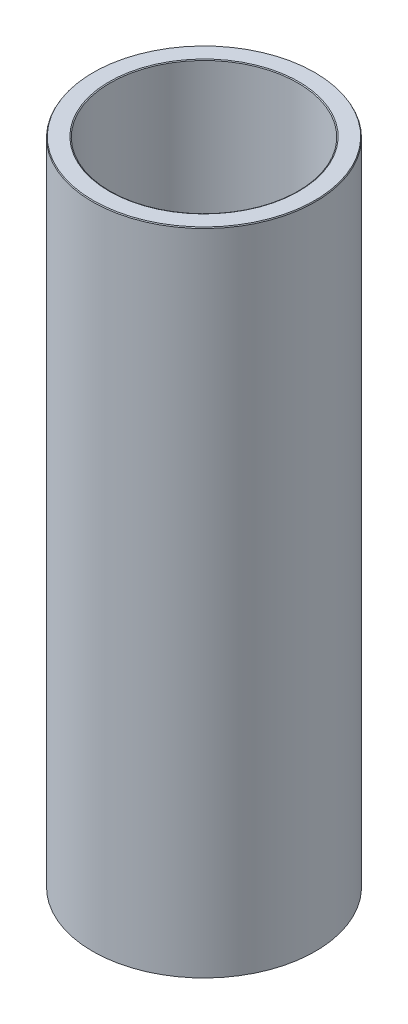
ISO-10303-21;
HEADER;
FILE_DESCRIPTION(('STEP AP214'),'2;1');
FILE_NAME('part.step','',(''),(''),'','','');
FILE_SCHEMA(('AUTOMOTIVE_DESIGN { 1 0 10303 214 1 1 1 1 }'));
ENDSEC;
DATA;
#1=APPLICATION_CONTEXT('core data for automotive mechanical design processes');
#2=APPLICATION_PROTOCOL_DEFINITION('international standard','automotive_design',2000,#1);
#3=PRODUCT_CONTEXT('',#1,'mechanical');
#4=PRODUCT('Part','Part','',(#3));
#5=PRODUCT_RELATED_PRODUCT_CATEGORY('part','',(#4));
#6=PRODUCT_DEFINITION_FORMATION('','',#4);
#7=PRODUCT_DEFINITION_CONTEXT('part definition',#1,'design');
#8=PRODUCT_DEFINITION('design','',#6,#7);
#9=PRODUCT_DEFINITION_SHAPE('','',#8);
#10=(LENGTH_UNIT() NAMED_UNIT(*) SI_UNIT(.MILLI.,.METRE.));
#11=(NAMED_UNIT(*) PLANE_ANGLE_UNIT() SI_UNIT($,.RADIAN.));
#12=(NAMED_UNIT(*) SI_UNIT($,.STERADIAN.) SOLID_ANGLE_UNIT());
#13=UNCERTAINTY_MEASURE_WITH_UNIT(LENGTH_MEASURE(1.E-05),#10,'distance_accuracy_value','');
#14=(GEOMETRIC_REPRESENTATION_CONTEXT(3) GLOBAL_UNCERTAINTY_ASSIGNED_CONTEXT((#13)) GLOBAL_UNIT_ASSIGNED_CONTEXT((#10,
#11,#12)) REPRESENTATION_CONTEXT('',''));
#15=CARTESIAN_POINT('',(0.,0.,0.));
#16=DIRECTION('',(0.,0.,1.));
#17=DIRECTION('',(1.,0.,0.));
#18=AXIS2_PLACEMENT_3D('',#15,#16,#17);
#19=CARTESIAN_POINT('',(0.,277.417146859064,0.));
#20=DIRECTION('',(0.,-1.,0.));
#21=DIRECTION('',(0.,0.,-1.));
#22=AXIS2_PLACEMENT_3D('',#19,#20,#21);
#23=CYLINDRICAL_SURFACE('',#22,47.5);
#24=CARTESIAN_POINT('',(0.,0.238274903493763,0.));
#25=DIRECTION('',(0.,1.,0.));
#26=DIRECTION('',(0.,0.,1.));
#27=AXIS2_PLACEMENT_3D('',#24,#25,#26);
#28=CIRCLE('',#27,47.5);
#29=CARTESIAN_POINT('',(0.,0.238274903493763,47.5));
#30=VERTEX_POINT('',#29);
#31=EDGE_CURVE('E10',#30,#30,#28,.T.);
#32=ORIENTED_EDGE('',*,*,#31,.T.);
#33=EDGE_LOOP('',(#32));
#34=FACE_BOUND('',#33,.T.);
#35=CARTESIAN_POINT('',(0.,277.004442620044,0.));
#36=DIRECTION('',(0.,1.,0.));
#37=DIRECTION('',(0.,0.,1.));
#38=AXIS2_PLACEMENT_3D('',#35,#36,#37);
#39=CIRCLE('',#38,47.5);
#40=CARTESIAN_POINT('',(0.,277.004442620044,47.5));
#41=VERTEX_POINT('',#40);
#42=EDGE_CURVE('E50',#41,#41,#39,.F.);
#43=ORIENTED_EDGE('',*,*,#42,.T.);
#44=EDGE_LOOP('',(#43));
#45=FACE_BOUND('',#44,.T.);
#46=ADVANCED_FACE('F39',(#34,#45),#23,.T.);
#47=CARTESIAN_POINT('',(0.,277.417146859064,0.));
#48=DIRECTION('',(0.,1.,0.));
#49=DIRECTION('',(0.,0.,1.));
#50=AXIS2_PLACEMENT_3D('',#47,#48,#49);
#51=PLANE('',#50);
#52=CARTESIAN_POINT('',(0.,277.417146859064,0.));
#53=DIRECTION('',(0.,1.,0.));
#54=DIRECTION('',(0.,0.,1.));
#55=AXIS2_PLACEMENT_3D('',#52,#53,#54);
#56=CIRCLE('',#55,40.4499099702416);
#57=CARTESIAN_POINT('',(0.,277.417146859064,40.4499099702416));
#58=VERTEX_POINT('',#57);
#59=EDGE_CURVE('E58',#58,#58,#56,.F.);
#60=ORIENTED_EDGE('',*,*,#59,.T.);
#61=EDGE_LOOP('',(#60));
#62=FACE_BOUND('',#61,.T.);
#63=CARTESIAN_POINT('',(0.,277.417146859064,0.));
#64=DIRECTION('',(0.,1.,0.));
#65=DIRECTION('',(0.,0.,1.));
#66=AXIS2_PLACEMENT_3D('',#63,#64,#65);
#67=CIRCLE('',#66,47.2617250965063);
#68=CARTESIAN_POINT('',(0.,277.417146859064,47.2617250965063));
#69=VERTEX_POINT('',#68);
#70=EDGE_CURVE('E61',#69,#69,#67,.T.);
#71=ORIENTED_EDGE('',*,*,#70,.T.);
#72=EDGE_LOOP('',(#71));
#73=FACE_BOUND('',#72,.T.);
#74=ADVANCED_FACE('F88',(#62,#73),#51,.T.);
#75=CARTESIAN_POINT('',(0.,0.,0.));
#76=DIRECTION('',(0.,1.,0.));
#77=DIRECTION('',(0.,0.,1.));
#78=AXIS2_PLACEMENT_3D('',#75,#76,#77);
#79=PLANE('',#78);
#80=CARTESIAN_POINT('',(0.,0.,0.));
#81=DIRECTION('',(0.,1.,0.));
#82=DIRECTION('',(0.,0.,1.));
#83=AXIS2_PLACEMENT_3D('',#80,#81,#82);
#84=CIRCLE('',#83,40.2754806347156);
#85=CARTESIAN_POINT('',(0.,0.,40.2754806347156));
#86=VERTEX_POINT('',#85);
#87=EDGE_CURVE('E51',#86,#86,#84,.T.);
#88=ORIENTED_EDGE('',*,*,#87,.T.);
#89=EDGE_LOOP('',(#88));
#90=FACE_BOUND('',#89,.T.);
#91=CARTESIAN_POINT('',(0.,0.,0.));
#92=DIRECTION('',(0.,1.,0.));
#93=DIRECTION('',(0.,0.,1.));
#94=AXIS2_PLACEMENT_3D('',#91,#92,#93);
#95=CIRCLE('',#94,47.0872957609803);
#96=CARTESIAN_POINT('',(0.,0.,47.0872957609803));
#97=VERTEX_POINT('',#96);
#98=EDGE_CURVE('E54',#97,#97,#95,.F.);
#99=ORIENTED_EDGE('',*,*,#98,.T.);
#100=EDGE_LOOP('',(#99));
#101=FACE_BOUND('',#100,.T.);
#102=ADVANCED_FACE('F83',(#90,#101),#79,.F.);
#103=CARTESIAN_POINT('',(0.,277.417146859064,0.));
#104=DIRECTION('',(0.,-1.,0.));
#105=DIRECTION('',(0.,0.,-1.));
#106=AXIS2_PLACEMENT_3D('',#103,#104,#105);
#107=CYLINDRICAL_SURFACE('',#106,40.0372057312218);
#108=CARTESIAN_POINT('',(0.,277.17887195557,0.));
#109=DIRECTION('',(0.,1.,0.));
#110=DIRECTION('',(0.,0.,1.));
#111=AXIS2_PLACEMENT_3D('',#108,#109,#110);
#112=CIRCLE('',#111,40.0372057312218);
#113=CARTESIAN_POINT('',(0.,277.17887195557,40.0372057312218));
#114=VERTEX_POINT('',#113);
#115=EDGE_CURVE('E67',#114,#114,#112,.T.);
#116=ORIENTED_EDGE('',*,*,#115,.T.);
#117=EDGE_LOOP('',(#116));
#118=FACE_BOUND('',#117,.T.);
#119=CARTESIAN_POINT('',(0.,0.41270423901979,0.));
#120=DIRECTION('',(0.,1.,0.));
#121=DIRECTION('',(0.,0.,1.));
#122=AXIS2_PLACEMENT_3D('',#119,#120,#121);
#123=CIRCLE('',#122,40.0372057312218);
#124=CARTESIAN_POINT('',(0.,0.41270423901979,40.0372057312218));
#125=VERTEX_POINT('',#124);
#126=EDGE_CURVE('E69',#125,#125,#123,.F.);
#127=ORIENTED_EDGE('',*,*,#126,.T.);
#128=EDGE_LOOP('',(#127));
#129=FACE_BOUND('',#128,.T.);
#130=ADVANCED_FACE('F71',(#118,#129),#107,.F.);
#131=CARTESIAN_POINT('',(0.,277.17887195557,0.));
#132=DIRECTION('',(0.,1.,0.));
#133=DIRECTION('',(0.,0.,1.));
#134=AXIS2_PLACEMENT_3D('',#131,#132,#133);
#135=CONICAL_SURFACE('',#134,40.0372057312218,1.04719755119654);
#136=ORIENTED_EDGE('',*,*,#59,.F.);
#137=EDGE_LOOP('',(#136));
#138=FACE_BOUND('',#137,.T.);
#139=ORIENTED_EDGE('',*,*,#115,.F.);
#140=EDGE_LOOP('',(#139));
#141=FACE_BOUND('',#140,.T.);
#142=ADVANCED_FACE('F77',(#138,#141),#135,.F.);
#143=CARTESIAN_POINT('',(0.,0.,0.));
#144=DIRECTION('',(0.,-1.,0.));
#145=DIRECTION('',(0.,0.,-1.));
#146=AXIS2_PLACEMENT_3D('',#143,#144,#145);
#147=CONICAL_SURFACE('',#146,40.2754806347156,0.523598775598263);
#148=ORIENTED_EDGE('',*,*,#126,.F.);
#149=EDGE_LOOP('',(#148));
#150=FACE_BOUND('',#149,.T.);
#151=ORIENTED_EDGE('',*,*,#87,.F.);
#152=EDGE_LOOP('',(#151));
#153=FACE_BOUND('',#152,.T.);
#154=ADVANCED_FACE('F73',(#150,#153),#147,.F.);
#155=CARTESIAN_POINT('',(0.,0.238274903493763,0.));
#156=DIRECTION('',(0.,1.,0.));
#157=DIRECTION('',(0.,0.,1.));
#158=AXIS2_PLACEMENT_3D('',#155,#156,#157);
#159=CONICAL_SURFACE('',#158,47.5,1.04719755119658);
#160=ORIENTED_EDGE('',*,*,#98,.F.);
#161=EDGE_LOOP('',(#160));
#162=FACE_BOUND('',#161,.T.);
#163=ORIENTED_EDGE('',*,*,#31,.F.);
#164=EDGE_LOOP('',(#163));
#165=FACE_BOUND('',#164,.T.);
#166=ADVANCED_FACE('F76',(#162,#165),#159,.T.);
#167=CARTESIAN_POINT('',(0.,277.417146859064,0.));
#168=DIRECTION('',(0.,-1.,0.));
#169=DIRECTION('',(0.,0.,-1.));
#170=AXIS2_PLACEMENT_3D('',#167,#168,#169);
#171=CONICAL_SURFACE('',#170,47.2617250965063,0.523598775598263);
#172=ORIENTED_EDGE('',*,*,#42,.F.);
#173=EDGE_LOOP('',(#172));
#174=FACE_BOUND('',#173,.T.);
#175=ORIENTED_EDGE('',*,*,#70,.F.);
#176=EDGE_LOOP('',(#175));
#177=FACE_BOUND('',#176,.T.);
#178=ADVANCED_FACE('F45',(#174,#177),#171,.T.);
#179=CLOSED_SHELL('',(#46,#74,#102,#130,#142,#154,#166,#178));
#180=MANIFOLD_SOLID_BREP('B2',#179);
#181=ADVANCED_BREP_SHAPE_REPRESENTATION('',(#18,#180),#14);
#182=SHAPE_DEFINITION_REPRESENTATION(#9,#181);
ENDSEC;
END-ISO-10303-21;
